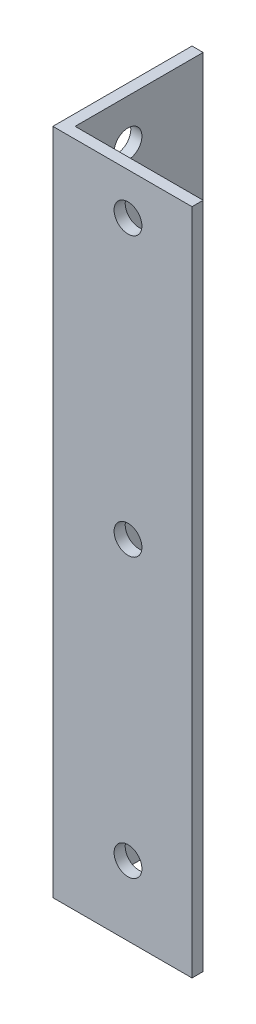
ISO-10303-21;
HEADER;
FILE_DESCRIPTION(('STEP AP214'),'2;1');
FILE_NAME('part.step','',(''),(''),'','','');
FILE_SCHEMA(('AUTOMOTIVE_DESIGN { 1 0 10303 214 1 1 1 1 }'));
ENDSEC;
DATA;
#1=APPLICATION_CONTEXT('core data for automotive mechanical design processes');
#2=APPLICATION_PROTOCOL_DEFINITION('international standard','automotive_design',2000,#1);
#3=PRODUCT_CONTEXT('',#1,'mechanical');
#4=PRODUCT('Part','Part','',(#3));
#5=PRODUCT_RELATED_PRODUCT_CATEGORY('part','',(#4));
#6=PRODUCT_DEFINITION_FORMATION('','',#4);
#7=PRODUCT_DEFINITION_CONTEXT('part definition',#1,'design');
#8=PRODUCT_DEFINITION('design','',#6,#7);
#9=PRODUCT_DEFINITION_SHAPE('','',#8);
#10=(LENGTH_UNIT() NAMED_UNIT(*) SI_UNIT(.MILLI.,.METRE.));
#11=(NAMED_UNIT(*) PLANE_ANGLE_UNIT() SI_UNIT($,.RADIAN.));
#12=(NAMED_UNIT(*) SI_UNIT($,.STERADIAN.) SOLID_ANGLE_UNIT());
#13=UNCERTAINTY_MEASURE_WITH_UNIT(LENGTH_MEASURE(1.E-05),#10,'distance_accuracy_value','');
#14=(GEOMETRIC_REPRESENTATION_CONTEXT(3) GLOBAL_UNCERTAINTY_ASSIGNED_CONTEXT((#13)) GLOBAL_UNIT_ASSIGNED_CONTEXT((#10,
#11,#12)) REPRESENTATION_CONTEXT('',''));
#15=CARTESIAN_POINT('',(0.,0.,0.));
#16=DIRECTION('',(0.,0.,1.));
#17=DIRECTION('',(1.,0.,0.));
#18=AXIS2_PLACEMENT_3D('',#15,#16,#17);
#19=CARTESIAN_POINT('',(4.,240.,0.));
#20=DIRECTION('',(-1.,0.,0.));
#21=DIRECTION('',(0.,0.,1.));
#22=AXIS2_PLACEMENT_3D('',#19,#20,#21);
#23=PLANE('',#22);
#24=CARTESIAN_POINT('',(4.,125.,-23.0000000000039));
#25=DIRECTION('',(-1.,0.,0.));
#26=DIRECTION('',(0.,0.,1.));
#27=AXIS2_PLACEMENT_3D('',#24,#25,#26);
#28=CIRCLE('',#27,4.99999999999999);
#29=CARTESIAN_POINT('',(4.,125.,-18.0000000000039));
#30=VERTEX_POINT('',#29);
#31=EDGE_CURVE('E189',#30,#30,#28,.T.);
#32=ORIENTED_EDGE('',*,*,#31,.T.);
#33=EDGE_LOOP('',(#32));
#34=FACE_BOUND('',#33,.T.);
#35=CARTESIAN_POINT('',(4.,25.,-23.));
#36=DIRECTION('',(-1.,0.,0.));
#37=DIRECTION('',(0.,0.,1.));
#38=AXIS2_PLACEMENT_3D('',#35,#36,#37);
#39=CIRCLE('',#38,5.);
#40=CARTESIAN_POINT('',(4.,25.,-18.));
#41=VERTEX_POINT('',#40);
#42=EDGE_CURVE('E193',#41,#41,#39,.T.);
#43=ORIENTED_EDGE('',*,*,#42,.T.);
#44=EDGE_LOOP('',(#43));
#45=FACE_BOUND('',#44,.T.);
#46=CARTESIAN_POINT('',(4.,225.,-23.0000000000078));
#47=DIRECTION('',(-1.,0.,0.));
#48=DIRECTION('',(0.,0.,1.));
#49=AXIS2_PLACEMENT_3D('',#46,#47,#48);
#50=CIRCLE('',#49,5.);
#51=CARTESIAN_POINT('',(4.,225.,-18.0000000000078));
#52=VERTEX_POINT('',#51);
#53=EDGE_CURVE('E150',#52,#52,#50,.T.);
#54=ORIENTED_EDGE('',*,*,#53,.T.);
#55=EDGE_LOOP('',(#54));
#56=FACE_BOUND('',#55,.T.);
#57=DIRECTION('',(0.,0.,-1.));
#58=VECTOR('',#57,1.);
#59=CARTESIAN_POINT('',(4.,0.,0.));
#60=LINE('',#59,#58);
#61=CARTESIAN_POINT('',(4.,0.,-4.));
#62=VERTEX_POINT('',#61);
#63=CARTESIAN_POINT('',(4.,0.,-50.));
#64=VERTEX_POINT('',#63);
#65=EDGE_CURVE('E118',#62,#64,#60,.T.);
#66=ORIENTED_EDGE('',*,*,#65,.T.);
#67=DIRECTION('',(0.,-1.,0.));
#68=VECTOR('',#67,1.);
#69=CARTESIAN_POINT('',(4.,240.,-50.));
#70=LINE('',#69,#68);
#71=CARTESIAN_POINT('',(4.,240.,-50.));
#72=VERTEX_POINT('',#71);
#73=EDGE_CURVE('E11',#72,#64,#70,.T.);
#74=ORIENTED_EDGE('',*,*,#73,.F.);
#75=DIRECTION('',(0.,0.,-1.));
#76=VECTOR('',#75,1.);
#77=CARTESIAN_POINT('',(4.,240.,0.));
#78=LINE('',#77,#76);
#79=CARTESIAN_POINT('',(4.,240.,-4.));
#80=VERTEX_POINT('',#79);
#81=EDGE_CURVE('E83',#80,#72,#78,.T.);
#82=ORIENTED_EDGE('',*,*,#81,.F.);
#83=DIRECTION('',(0.,-1.,0.));
#84=VECTOR('',#83,1.);
#85=CARTESIAN_POINT('',(4.,240.,-4.));
#86=LINE('',#85,#84);
#87=EDGE_CURVE('E114',#80,#62,#86,.T.);
#88=ORIENTED_EDGE('',*,*,#87,.T.);
#89=EDGE_LOOP('',(#66,#74,#82,#88));
#90=FACE_BOUND('',#89,.T.);
#91=ADVANCED_FACE('F35',(#34,#45,#56,#90),#23,.F.);
#92=CARTESIAN_POINT('',(0.,240.,-50.));
#93=DIRECTION('',(0.,0.,-1.));
#94=DIRECTION('',(-1.,0.,0.));
#95=AXIS2_PLACEMENT_3D('',#92,#93,#94);
#96=PLANE('',#95);
#97=DIRECTION('',(1.,0.,0.));
#98=VECTOR('',#97,1.);
#99=CARTESIAN_POINT('',(0.,0.,-50.));
#100=LINE('',#99,#98);
#101=CARTESIAN_POINT('',(0.,0.,-50.));
#102=VERTEX_POINT('',#101);
#103=EDGE_CURVE('E121',#102,#64,#100,.T.);
#104=ORIENTED_EDGE('',*,*,#103,.F.);
#105=DIRECTION('',(0.,-1.,0.));
#106=VECTOR('',#105,1.);
#107=CARTESIAN_POINT('',(0.,240.,-50.));
#108=LINE('',#107,#106);
#109=CARTESIAN_POINT('',(0.,240.,-50.));
#110=VERTEX_POINT('',#109);
#111=EDGE_CURVE('E44',#110,#102,#108,.T.);
#112=ORIENTED_EDGE('',*,*,#111,.F.);
#113=DIRECTION('',(1.,0.,0.));
#114=VECTOR('',#113,1.);
#115=CARTESIAN_POINT('',(0.,240.,-50.));
#116=LINE('',#115,#114);
#117=EDGE_CURVE('E158',#110,#72,#116,.T.);
#118=ORIENTED_EDGE('',*,*,#117,.T.);
#119=ORIENTED_EDGE('',*,*,#73,.T.);
#120=EDGE_LOOP('',(#104,#112,#118,#119));
#121=FACE_BOUND('',#120,.T.);
#122=ADVANCED_FACE('F180',(#121),#96,.T.);
#123=CARTESIAN_POINT('',(0.,240.,0.));
#124=DIRECTION('',(-1.,0.,0.));
#125=DIRECTION('',(0.,0.,1.));
#126=AXIS2_PLACEMENT_3D('',#123,#124,#125);
#127=PLANE('',#126);
#128=CARTESIAN_POINT('',(0.,125.,-23.0000000000039));
#129=DIRECTION('',(-1.,0.,0.));
#130=DIRECTION('',(0.,0.,1.));
#131=AXIS2_PLACEMENT_3D('',#128,#129,#130);
#132=CIRCLE('',#131,4.99999999999999);
#133=CARTESIAN_POINT('',(0.,125.,-18.0000000000039));
#134=VERTEX_POINT('',#133);
#135=EDGE_CURVE('E204',#134,#134,#132,.T.);
#136=ORIENTED_EDGE('',*,*,#135,.F.);
#137=EDGE_LOOP('',(#136));
#138=FACE_BOUND('',#137,.T.);
#139=CARTESIAN_POINT('',(0.,25.,-23.));
#140=DIRECTION('',(-1.,0.,0.));
#141=DIRECTION('',(0.,0.,1.));
#142=AXIS2_PLACEMENT_3D('',#139,#140,#141);
#143=CIRCLE('',#142,5.);
#144=CARTESIAN_POINT('',(0.,25.,-18.));
#145=VERTEX_POINT('',#144);
#146=EDGE_CURVE('E205',#145,#145,#143,.T.);
#147=ORIENTED_EDGE('',*,*,#146,.F.);
#148=EDGE_LOOP('',(#147));
#149=FACE_BOUND('',#148,.T.);
#150=CARTESIAN_POINT('',(0.,225.,-23.0000000000078));
#151=DIRECTION('',(-1.,0.,0.));
#152=DIRECTION('',(0.,0.,1.));
#153=AXIS2_PLACEMENT_3D('',#150,#151,#152);
#154=CIRCLE('',#153,5.);
#155=CARTESIAN_POINT('',(0.,225.,-18.0000000000078));
#156=VERTEX_POINT('',#155);
#157=EDGE_CURVE('E197',#156,#156,#154,.T.);
#158=ORIENTED_EDGE('',*,*,#157,.F.);
#159=EDGE_LOOP('',(#158));
#160=FACE_BOUND('',#159,.T.);
#161=DIRECTION('',(0.,0.,-1.));
#162=VECTOR('',#161,1.);
#163=CARTESIAN_POINT('',(0.,0.,0.));
#164=LINE('',#163,#162);
#165=CARTESIAN_POINT('',(0.,0.,0.));
#166=VERTEX_POINT('',#165);
#167=EDGE_CURVE('E125',#166,#102,#164,.T.);
#168=ORIENTED_EDGE('',*,*,#167,.F.);
#169=DIRECTION('',(0.,-1.,0.));
#170=VECTOR('',#169,1.);
#171=CARTESIAN_POINT('',(0.,240.,0.));
#172=LINE('',#171,#170);
#173=CARTESIAN_POINT('',(0.,240.,0.));
#174=VERTEX_POINT('',#173);
#175=EDGE_CURVE('E104',#174,#166,#172,.T.);
#176=ORIENTED_EDGE('',*,*,#175,.F.);
#177=DIRECTION('',(0.,0.,-1.));
#178=VECTOR('',#177,1.);
#179=CARTESIAN_POINT('',(0.,240.,0.));
#180=LINE('',#179,#178);
#181=EDGE_CURVE('E110',#174,#110,#180,.T.);
#182=ORIENTED_EDGE('',*,*,#181,.T.);
#183=ORIENTED_EDGE('',*,*,#111,.T.);
#184=EDGE_LOOP('',(#168,#176,#182,#183));
#185=FACE_BOUND('',#184,.T.);
#186=ADVANCED_FACE('F162',(#138,#149,#160,#185),#127,.T.);
#187=CARTESIAN_POINT('',(0.,240.,0.));
#188=DIRECTION('',(0.,0.,1.));
#189=DIRECTION('',(1.,0.,0.));
#190=AXIS2_PLACEMENT_3D('',#187,#188,#189);
#191=PLANE('',#190);
#192=CARTESIAN_POINT('',(26.9999999999961,125.,0.));
#193=DIRECTION('',(0.,0.,1.));
#194=DIRECTION('',(1.,0.,0.));
#195=AXIS2_PLACEMENT_3D('',#192,#193,#194);
#196=CIRCLE('',#195,5.00000000000001);
#197=CARTESIAN_POINT('',(31.9999999999961,125.,0.));
#198=VERTEX_POINT('',#197);
#199=EDGE_CURVE('E140',#198,#198,#196,.T.);
#200=ORIENTED_EDGE('',*,*,#199,.F.);
#201=EDGE_LOOP('',(#200));
#202=FACE_BOUND('',#201,.T.);
#203=CARTESIAN_POINT('',(27.,25.,0.));
#204=DIRECTION('',(0.,0.,1.));
#205=DIRECTION('',(1.,0.,0.));
#206=AXIS2_PLACEMENT_3D('',#203,#204,#205);
#207=CIRCLE('',#206,5.);
#208=CARTESIAN_POINT('',(32.,25.,0.));
#209=VERTEX_POINT('',#208);
#210=EDGE_CURVE('E145',#209,#209,#207,.T.);
#211=ORIENTED_EDGE('',*,*,#210,.F.);
#212=EDGE_LOOP('',(#211));
#213=FACE_BOUND('',#212,.T.);
#214=CARTESIAN_POINT('',(26.9999999999922,225.,0.));
#215=DIRECTION('',(0.,0.,1.));
#216=DIRECTION('',(1.,0.,0.));
#217=AXIS2_PLACEMENT_3D('',#214,#215,#216);
#218=CIRCLE('',#217,5.);
#219=CARTESIAN_POINT('',(31.9999999999922,225.,0.));
#220=VERTEX_POINT('',#219);
#221=EDGE_CURVE('E137',#220,#220,#218,.T.);
#222=ORIENTED_EDGE('',*,*,#221,.F.);
#223=EDGE_LOOP('',(#222));
#224=FACE_BOUND('',#223,.T.);
#225=DIRECTION('',(-1.,0.,0.));
#226=VECTOR('',#225,1.);
#227=CARTESIAN_POINT('',(0.,0.,0.));
#228=LINE('',#227,#226);
#229=CARTESIAN_POINT('',(50.,0.,0.));
#230=VERTEX_POINT('',#229);
#231=EDGE_CURVE('E99',#230,#166,#228,.T.);
#232=ORIENTED_EDGE('',*,*,#231,.F.);
#233=DIRECTION('',(0.,-1.,0.));
#234=VECTOR('',#233,1.);
#235=CARTESIAN_POINT('',(50.,240.,0.));
#236=LINE('',#235,#234);
#237=CARTESIAN_POINT('',(50.,240.,0.));
#238=VERTEX_POINT('',#237);
#239=EDGE_CURVE('E94',#238,#230,#236,.T.);
#240=ORIENTED_EDGE('',*,*,#239,.F.);
#241=DIRECTION('',(-1.,0.,0.));
#242=VECTOR('',#241,1.);
#243=CARTESIAN_POINT('',(0.,240.,0.));
#244=LINE('',#243,#242);
#245=EDGE_CURVE('E97',#238,#174,#244,.T.);
#246=ORIENTED_EDGE('',*,*,#245,.T.);
#247=ORIENTED_EDGE('',*,*,#175,.T.);
#248=EDGE_LOOP('',(#232,#240,#246,#247));
#249=FACE_BOUND('',#248,.T.);
#250=ADVANCED_FACE('F96',(#202,#213,#224,#249),#191,.T.);
#251=CARTESIAN_POINT('',(50.,240.,-4.));
#252=DIRECTION('',(1.,0.,0.));
#253=DIRECTION('',(0.,0.,-1.));
#254=AXIS2_PLACEMENT_3D('',#251,#252,#253);
#255=PLANE('',#254);
#256=DIRECTION('',(0.,0.,1.));
#257=VECTOR('',#256,1.);
#258=CARTESIAN_POINT('',(50.,0.,-4.));
#259=LINE('',#258,#257);
#260=CARTESIAN_POINT('',(50.,0.,-4.));
#261=VERTEX_POINT('',#260);
#262=EDGE_CURVE('E129',#261,#230,#259,.T.);
#263=ORIENTED_EDGE('',*,*,#262,.F.);
#264=DIRECTION('',(0.,-1.,0.));
#265=VECTOR('',#264,1.);
#266=CARTESIAN_POINT('',(50.,240.,-4.));
#267=LINE('',#266,#265);
#268=CARTESIAN_POINT('',(50.,240.,-4.));
#269=VERTEX_POINT('',#268);
#270=EDGE_CURVE('E74',#269,#261,#267,.T.);
#271=ORIENTED_EDGE('',*,*,#270,.F.);
#272=DIRECTION('',(0.,0.,1.));
#273=VECTOR('',#272,1.);
#274=CARTESIAN_POINT('',(50.,240.,-4.));
#275=LINE('',#274,#273);
#276=EDGE_CURVE('E108',#269,#238,#275,.T.);
#277=ORIENTED_EDGE('',*,*,#276,.T.);
#278=ORIENTED_EDGE('',*,*,#239,.T.);
#279=EDGE_LOOP('',(#263,#271,#277,#278));
#280=FACE_BOUND('',#279,.T.);
#281=ADVANCED_FACE('F112',(#280),#255,.T.);
#282=CARTESIAN_POINT('',(0.,240.,-4.));
#283=DIRECTION('',(0.,0.,1.));
#284=DIRECTION('',(1.,0.,0.));
#285=AXIS2_PLACEMENT_3D('',#282,#283,#284);
#286=PLANE('',#285);
#287=CARTESIAN_POINT('',(26.9999999999961,125.,-4.));
#288=DIRECTION('',(0.,0.,1.));
#289=DIRECTION('',(1.,0.,0.));
#290=AXIS2_PLACEMENT_3D('',#287,#288,#289);
#291=CIRCLE('',#290,5.00000000000001);
#292=CARTESIAN_POINT('',(31.9999999999961,125.,-4.));
#293=VERTEX_POINT('',#292);
#294=EDGE_CURVE('E38',#293,#293,#291,.T.);
#295=ORIENTED_EDGE('',*,*,#294,.T.);
#296=EDGE_LOOP('',(#295));
#297=FACE_BOUND('',#296,.T.);
#298=CARTESIAN_POINT('',(27.,25.,-4.));
#299=DIRECTION('',(0.,0.,1.));
#300=DIRECTION('',(1.,0.,0.));
#301=AXIS2_PLACEMENT_3D('',#298,#299,#300);
#302=CIRCLE('',#301,5.);
#303=CARTESIAN_POINT('',(32.,25.,-4.));
#304=VERTEX_POINT('',#303);
#305=EDGE_CURVE('E138',#304,#304,#302,.T.);
#306=ORIENTED_EDGE('',*,*,#305,.T.);
#307=EDGE_LOOP('',(#306));
#308=FACE_BOUND('',#307,.T.);
#309=CARTESIAN_POINT('',(26.9999999999922,225.,-4.));
#310=DIRECTION('',(0.,0.,1.));
#311=DIRECTION('',(1.,0.,0.));
#312=AXIS2_PLACEMENT_3D('',#309,#310,#311);
#313=CIRCLE('',#312,5.);
#314=CARTESIAN_POINT('',(31.9999999999922,225.,-4.));
#315=VERTEX_POINT('',#314);
#316=EDGE_CURVE('E122',#315,#315,#313,.T.);
#317=ORIENTED_EDGE('',*,*,#316,.T.);
#318=EDGE_LOOP('',(#317));
#319=FACE_BOUND('',#318,.T.);
#320=DIRECTION('',(1.,0.,0.));
#321=VECTOR('',#320,1.);
#322=CARTESIAN_POINT('',(0.,0.,-4.));
#323=LINE('',#322,#321);
#324=EDGE_CURVE('E77',#261,#62,#323,.F.);
#325=ORIENTED_EDGE('',*,*,#324,.T.);
#326=ORIENTED_EDGE('',*,*,#87,.F.);
#327=DIRECTION('',(1.,0.,0.));
#328=VECTOR('',#327,1.);
#329=CARTESIAN_POINT('',(0.,240.,-4.));
#330=LINE('',#329,#328);
#331=EDGE_CURVE('E53',#269,#80,#330,.F.);
#332=ORIENTED_EDGE('',*,*,#331,.F.);
#333=ORIENTED_EDGE('',*,*,#270,.T.);
#334=EDGE_LOOP('',(#325,#326,#332,#333));
#335=FACE_BOUND('',#334,.T.);
#336=ADVANCED_FACE('F168',(#297,#308,#319,#335),#286,.F.);
#337=CARTESIAN_POINT('',(0.,240.,0.));
#338=DIRECTION('',(0.,-1.,0.));
#339=DIRECTION('',(-1.,0.,0.));
#340=AXIS2_PLACEMENT_3D('',#337,#338,#339);
#341=PLANE('',#340);
#342=ORIENTED_EDGE('',*,*,#81,.T.);
#343=ORIENTED_EDGE('',*,*,#117,.F.);
#344=ORIENTED_EDGE('',*,*,#181,.F.);
#345=ORIENTED_EDGE('',*,*,#245,.F.);
#346=ORIENTED_EDGE('',*,*,#276,.F.);
#347=ORIENTED_EDGE('',*,*,#331,.T.);
#348=EDGE_LOOP('',(#342,#343,#344,#345,#346,#347));
#349=FACE_BOUND('',#348,.T.);
#350=ADVANCED_FACE('F107',(#349),#341,.F.);
#351=CARTESIAN_POINT('',(0.,0.,0.));
#352=DIRECTION('',(0.,-1.,0.));
#353=DIRECTION('',(-1.,0.,0.));
#354=AXIS2_PLACEMENT_3D('',#351,#352,#353);
#355=PLANE('',#354);
#356=ORIENTED_EDGE('',*,*,#65,.F.);
#357=ORIENTED_EDGE('',*,*,#324,.F.);
#358=ORIENTED_EDGE('',*,*,#262,.T.);
#359=ORIENTED_EDGE('',*,*,#231,.T.);
#360=ORIENTED_EDGE('',*,*,#167,.T.);
#361=ORIENTED_EDGE('',*,*,#103,.T.);
#362=EDGE_LOOP('',(#356,#357,#358,#359,#360,#361));
#363=FACE_BOUND('',#362,.T.);
#364=ADVANCED_FACE('F166',(#363),#355,.T.);
#365=CARTESIAN_POINT('',(26.9999999999922,225.,-10.));
#366=DIRECTION('',(0.,0.,1.));
#367=DIRECTION('',(1.,0.,0.));
#368=AXIS2_PLACEMENT_3D('',#365,#366,#367);
#369=CYLINDRICAL_SURFACE('',#368,5.);
#370=ORIENTED_EDGE('',*,*,#221,.T.);
#371=EDGE_LOOP('',(#370));
#372=FACE_BOUND('',#371,.T.);
#373=ORIENTED_EDGE('',*,*,#316,.F.);
#374=EDGE_LOOP('',(#373));
#375=FACE_BOUND('',#374,.T.);
#376=ADVANCED_FACE('F238',(#372,#375),#369,.F.);
#377=CARTESIAN_POINT('',(27.,25.,-10.));
#378=DIRECTION('',(0.,0.,1.));
#379=DIRECTION('',(1.,0.,0.));
#380=AXIS2_PLACEMENT_3D('',#377,#378,#379);
#381=CYLINDRICAL_SURFACE('',#380,5.);
#382=ORIENTED_EDGE('',*,*,#210,.T.);
#383=EDGE_LOOP('',(#382));
#384=FACE_BOUND('',#383,.T.);
#385=ORIENTED_EDGE('',*,*,#305,.F.);
#386=EDGE_LOOP('',(#385));
#387=FACE_BOUND('',#386,.T.);
#388=ADVANCED_FACE('F235',(#384,#387),#381,.F.);
#389=CARTESIAN_POINT('',(26.9999999999961,125.,-10.));
#390=DIRECTION('',(0.,0.,1.));
#391=DIRECTION('',(1.,0.,0.));
#392=AXIS2_PLACEMENT_3D('',#389,#390,#391);
#393=CYLINDRICAL_SURFACE('',#392,5.00000000000001);
#394=ORIENTED_EDGE('',*,*,#199,.T.);
#395=EDGE_LOOP('',(#394));
#396=FACE_BOUND('',#395,.T.);
#397=ORIENTED_EDGE('',*,*,#294,.F.);
#398=EDGE_LOOP('',(#397));
#399=FACE_BOUND('',#398,.T.);
#400=ADVANCED_FACE('F230',(#396,#399),#393,.F.);
#401=CARTESIAN_POINT('',(10.,225.,-23.0000000000078));
#402=DIRECTION('',(-1.,0.,0.));
#403=DIRECTION('',(0.,0.,1.));
#404=AXIS2_PLACEMENT_3D('',#401,#402,#403);
#405=CYLINDRICAL_SURFACE('',#404,5.);
#406=ORIENTED_EDGE('',*,*,#157,.T.);
#407=EDGE_LOOP('',(#406));
#408=FACE_BOUND('',#407,.T.);
#409=ORIENTED_EDGE('',*,*,#53,.F.);
#410=EDGE_LOOP('',(#409));
#411=FACE_BOUND('',#410,.T.);
#412=ADVANCED_FACE('F223',(#408,#411),#405,.F.);
#413=CARTESIAN_POINT('',(10.,25.,-23.));
#414=DIRECTION('',(-1.,0.,0.));
#415=DIRECTION('',(0.,0.,1.));
#416=AXIS2_PLACEMENT_3D('',#413,#414,#415);
#417=CYLINDRICAL_SURFACE('',#416,5.);
#418=ORIENTED_EDGE('',*,*,#146,.T.);
#419=EDGE_LOOP('',(#418));
#420=FACE_BOUND('',#419,.T.);
#421=ORIENTED_EDGE('',*,*,#42,.F.);
#422=EDGE_LOOP('',(#421));
#423=FACE_BOUND('',#422,.T.);
#424=ADVANCED_FACE('F220',(#420,#423),#417,.F.);
#425=CARTESIAN_POINT('',(10.,125.,-23.0000000000039));
#426=DIRECTION('',(-1.,0.,0.));
#427=DIRECTION('',(0.,0.,1.));
#428=AXIS2_PLACEMENT_3D('',#425,#426,#427);
#429=CYLINDRICAL_SURFACE('',#428,4.99999999999999);
#430=ORIENTED_EDGE('',*,*,#135,.T.);
#431=EDGE_LOOP('',(#430));
#432=FACE_BOUND('',#431,.T.);
#433=ORIENTED_EDGE('',*,*,#31,.F.);
#434=EDGE_LOOP('',(#433));
#435=FACE_BOUND('',#434,.T.);
#436=ADVANCED_FACE('F211',(#432,#435),#429,.F.);
#437=CLOSED_SHELL('',(#91,#122,#186,#250,#281,#336,#350,#364,#376,#388,#400,#412,#424,#436));
#438=MANIFOLD_SOLID_BREP('B2',#437);
#439=ADVANCED_BREP_SHAPE_REPRESENTATION('',(#18,#438),#14);
#440=SHAPE_DEFINITION_REPRESENTATION(#9,#439);
ENDSEC;
END-ISO-10303-21;
